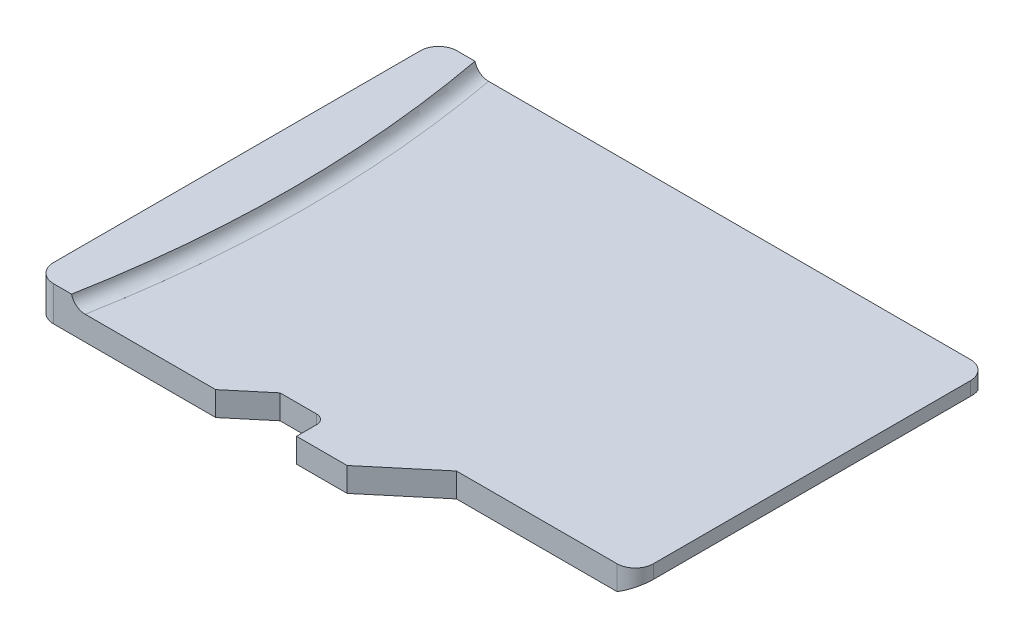
ISO-10303-21;
HEADER;
FILE_DESCRIPTION(('STEP AP214'),'2;1');
FILE_NAME('part.step','',(''),(''),'','','');
FILE_SCHEMA(('AUTOMOTIVE_DESIGN { 1 0 10303 214 1 1 1 1 }'));
ENDSEC;
DATA;
#1=APPLICATION_CONTEXT('core data for automotive mechanical design processes');
#2=APPLICATION_PROTOCOL_DEFINITION('international standard','automotive_design',2000,#1);
#3=PRODUCT_CONTEXT('',#1,'mechanical');
#4=PRODUCT('Part','Part','',(#3));
#5=PRODUCT_RELATED_PRODUCT_CATEGORY('part','',(#4));
#6=PRODUCT_DEFINITION_FORMATION('','',#4);
#7=PRODUCT_DEFINITION_CONTEXT('part definition',#1,'design');
#8=PRODUCT_DEFINITION('design','',#6,#7);
#9=PRODUCT_DEFINITION_SHAPE('','',#8);
#10=(LENGTH_UNIT() NAMED_UNIT(*) SI_UNIT(.MILLI.,.METRE.));
#11=(NAMED_UNIT(*) PLANE_ANGLE_UNIT() SI_UNIT($,.RADIAN.));
#12=(NAMED_UNIT(*) SI_UNIT($,.STERADIAN.) SOLID_ANGLE_UNIT());
#13=UNCERTAINTY_MEASURE_WITH_UNIT(LENGTH_MEASURE(1.E-05),#10,'distance_accuracy_value','');
#14=(GEOMETRIC_REPRESENTATION_CONTEXT(3) GLOBAL_UNCERTAINTY_ASSIGNED_CONTEXT((#13)) GLOBAL_UNIT_ASSIGNED_CONTEXT((#10,
#11,#12)) REPRESENTATION_CONTEXT('',''));
#15=CARTESIAN_POINT('',(0.,0.,0.));
#16=DIRECTION('',(0.,0.,1.));
#17=DIRECTION('',(1.,0.,0.));
#18=AXIS2_PLACEMENT_3D('',#15,#16,#17);
#19=CARTESIAN_POINT('',(-35.9999999999996,1.0349999999999,0.));
#20=DIRECTION('',(0.,1.,0.));
#21=DIRECTION('',(0.,0.,1.));
#22=AXIS2_PLACEMENT_3D('',#19,#20,#21);
#23=TOROIDAL_SURFACE('',#22,30.365239647355,0.375);
#24=CARTESIAN_POINT('',(-35.9999999999996,0.6599999999999,0.));
#25=DIRECTION('',(0.,1.,0.));
#26=DIRECTION('',(0.983459500680866,0.,0.181128160484617));
#27=AXIS2_PLACEMENT_3D('',#24,#25,#26);
#28=CIRCLE('',#27,30.365239647355);
#29=CARTESIAN_POINT('',(-6.13701657835701,0.659999999999921,-5.50000000000005));
#30=VERTEX_POINT('',#29);
#31=CARTESIAN_POINT('',(-6.13701657835701,0.659999999999916,5.49999999999994));
#32=VERTEX_POINT('',#31);
#33=EDGE_CURVE('E102',#30,#32,#28,.F.);
#34=ORIENTED_EDGE('',*,*,#33,.F.);
#35=CARTESIAN_POINT('',(-6.50847579388233,0.949999999999903,-5.50000000000001));
#36=CARTESIAN_POINT('',(-6.50365678408364,0.929561651859177,-5.49999999999993));
#37=CARTESIAN_POINT('',(-6.49706309852533,0.909553416438354,-5.49999999999996));
#38=CARTESIAN_POINT('',(-6.48061867510301,0.870947894944131,-5.50000000000004));
#39=CARTESIAN_POINT('',(-6.47077153495664,0.852349078119381,-5.50000000000007));
#40=CARTESIAN_POINT('',(-6.44809939187905,0.817063812499311,-5.49999999999993));
#41=CARTESIAN_POINT('',(-6.4352740644349,0.800377572400687,-5.49999999999975));
#42=CARTESIAN_POINT('',(-6.40703675834054,0.769368791134943,-5.50000000000025));
#43=CARTESIAN_POINT('',(-6.39162526762855,0.755045805095586,-5.50000000000093));
#44=CARTESIAN_POINT('',(-6.35847645560867,0.728991696924084,-5.50000000000088));
#45=CARTESIAN_POINT('',(-6.34071570183443,0.717290399392818,-5.50000000000013));
#46=CARTESIAN_POINT('',(-6.3034989545367,0.696974508359801,-5.49999999999987));
#47=CARTESIAN_POINT('',(-6.28404211499242,0.688361466383208,-5.50000000000037));
#48=CARTESIAN_POINT('',(-6.24364018092561,0.674332607153745,-5.50000000000056));
#49=CARTESIAN_POINT('',(-6.22267552736294,0.668973134458895,-5.50000000000025));
#50=CARTESIAN_POINT('',(-6.18014701708768,0.661798485204094,-5.49999999999975));
#51=CARTESIAN_POINT('',(-6.15858311235204,0.659983593536863,-5.49999999999958));
#52=CARTESIAN_POINT('',(-6.13701657835932,0.659999999999901,-5.49999999999995));
#53=B_SPLINE_CURVE_WITH_KNOTS('',3,(#35,#36,#37,#38,#39,#40,#41,#42,#43,#44,#45,#46,#47,#48,#49,
#50,#51,#52),.UNSPECIFIED.,.F.,.F.,(4,2,2,2,2,2,2,2,4),(0.,0.0629044013254682,0.125739473567217,
0.188581395737005,0.251411474659881,0.314923622270864,0.378467633526515,0.443082833003335,
0.507703225658798),.UNSPECIFIED.);
#54=CARTESIAN_POINT('',(-6.50847579388233,0.949999999999898,-5.50000000000006));
#55=VERTEX_POINT('',#54);
#56=EDGE_CURVE('E98',#55,#30,#53,.T.);
#57=ORIENTED_EDGE('',*,*,#56,.F.);
#58=CARTESIAN_POINT('',(-35.9999999999996,0.949999999999892,0.));
#59=DIRECTION('',(0.,1.,0.));
#60=DIRECTION('',(0.,0.,1.));
#61=AXIS2_PLACEMENT_3D('',#58,#59,#60);
#62=CIRCLE('',#61,30.);
#63=CARTESIAN_POINT('',(-6.50847579388234,0.949999999999893,5.49999999999995));
#64=VERTEX_POINT('',#63);
#65=EDGE_CURVE('E100',#64,#55,#62,.T.);
#66=ORIENTED_EDGE('',*,*,#65,.F.);
#67=CARTESIAN_POINT('',(-6.13701657835701,0.659999999999899,5.5));
#68=CARTESIAN_POINT('',(-6.15873580518454,0.659983345221313,5.49999999999874));
#69=CARTESIAN_POINT('',(-6.18045166643814,0.661824063070222,5.49999999999926));
#70=CARTESIAN_POINT('',(-6.22327323802776,0.669100141857668,5.50000000000074));
#71=CARTESIAN_POINT('',(-6.2443789444063,0.674535526105842,5.50000000000171));
#72=CARTESIAN_POINT('',(-6.28538790626051,0.688884827550821,5.50000000000095));
#73=CARTESIAN_POINT('',(-6.30529048546467,0.697800680486134,5.49999999999923));
#74=CARTESIAN_POINT('',(-6.34329276541259,0.718867251841736,5.50000000000077));
#75=CARTESIAN_POINT('',(-6.36139328218469,0.731016496845015,5.50000000000404));
#76=CARTESIAN_POINT('',(-6.39513178254897,0.758122729346288,5.50000000000419));
#77=CARTESIAN_POINT('',(-6.41078711201319,0.773058118546989,5.50000000000113));
#78=CARTESIAN_POINT('',(-6.43932177140287,0.805386342610011,5.49999999999887));
#79=CARTESIAN_POINT('',(-6.45220094210723,0.82277931832768,5.49999999999969));
#80=CARTESIAN_POINT('',(-6.47380038096847,0.857945737493751,5.50000000000028));
#81=CARTESIAN_POINT('',(-6.48278238156848,0.875558995131556,5.50000000000014));
#82=CARTESIAN_POINT('',(-6.49785556998301,0.911988044157125,5.49999999999986));
#83=CARTESIAN_POINT('',(-6.5039457336987,0.930804258880781,5.49999999999972));
#84=CARTESIAN_POINT('',(-6.50847579388235,0.949999999999894,5.5));
#85=B_SPLINE_CURVE_WITH_KNOTS('',3,(#67,#68,#69,#70,#71,#72,#73,#74,#75,#76,#77,#78,#79,#80,#81,
#82,#83,#84),.UNSPECIFIED.,.F.,.F.,(4,2,2,2,2,2,2,2,4),(0.,0.0650754392229196,0.130151300432072,
0.195263406684142,0.260345892802461,0.324943377164729,0.389544565402615,0.448612561357574,
0.507701459747772),.UNSPECIFIED.);
#86=EDGE_CURVE('E106',#32,#64,#85,.T.);
#87=ORIENTED_EDGE('',*,*,#86,.F.);
#88=EDGE_LOOP('',(#34,#57,#66,#87));
#89=FACE_BOUND('',#88,.T.);
#90=ADVANCED_FACE('F17',(#89),#23,.F.);
#91=CARTESIAN_POINT('',(-6.99999999999959,0.949999999999891,4.99999999999989));
#92=DIRECTION('',(0.,1.,0.));
#93=DIRECTION('',(0.,0.,1.));
#94=AXIS2_PLACEMENT_3D('',#91,#92,#93);
#95=PLANE('',#94);
#96=DIRECTION('',(0.,0.,-1.));
#97=VECTOR('',#96,1.);
#98=CARTESIAN_POINT('',(-7.5,0.9499999999999,-5.));
#99=LINE('',#98,#97);
#100=CARTESIAN_POINT('',(-7.5,0.9499999999999,-5.));
#101=VERTEX_POINT('',#100);
#102=CARTESIAN_POINT('',(-7.5,0.9499999999999,4.99999999999995));
#103=VERTEX_POINT('',#102);
#104=EDGE_CURVE('E123',#101,#103,#99,.F.);
#105=ORIENTED_EDGE('',*,*,#104,.T.);
#106=CARTESIAN_POINT('',(-7.,0.9499999999999,5.));
#107=DIRECTION('',(0.,-1.,0.));
#108=DIRECTION('',(0.,0.,-1.));
#109=AXIS2_PLACEMENT_3D('',#106,#107,#108);
#110=CIRCLE('',#109,0.5);
#111=CARTESIAN_POINT('',(-7.,0.9499999999999,5.49999999999995));
#112=VERTEX_POINT('',#111);
#113=EDGE_CURVE('E117',#103,#112,#110,.F.);
#114=ORIENTED_EDGE('',*,*,#113,.T.);
#115=DIRECTION('',(1.,0.,0.));
#116=VECTOR('',#115,1.);
#117=CARTESIAN_POINT('',(-6.99999999999959,0.949999999999891,5.4999999999999));
#118=LINE('',#117,#116);
#119=EDGE_CURVE('E91',#112,#64,#118,.T.);
#120=ORIENTED_EDGE('',*,*,#119,.T.);
#121=ORIENTED_EDGE('',*,*,#65,.T.);
#122=DIRECTION('',(1.,0.,0.));
#123=VECTOR('',#122,1.);
#124=CARTESIAN_POINT('',(-6.99999999999959,0.949999999999894,-5.50000000000011));
#125=LINE('',#124,#123);
#126=CARTESIAN_POINT('',(-6.99999999999979,0.9499999999999,-5.50000000000005));
#127=VERTEX_POINT('',#126);
#128=EDGE_CURVE('E110',#55,#127,#125,.F.);
#129=ORIENTED_EDGE('',*,*,#128,.T.);
#130=CARTESIAN_POINT('',(-7.,0.9499999999999,-5.));
#131=DIRECTION('',(0.,-1.,0.));
#132=DIRECTION('',(0.,0.,-1.));
#133=AXIS2_PLACEMENT_3D('',#130,#131,#132);
#134=CIRCLE('',#133,0.5);
#135=EDGE_CURVE('E161',#101,#127,#134,.T.);
#136=ORIENTED_EDGE('',*,*,#135,.F.);
#137=EDGE_LOOP('',(#105,#114,#120,#121,#129,#136));
#138=FACE_BOUND('',#137,.T.);
#139=ADVANCED_FACE('F108',(#138),#95,.T.);
#140=CARTESIAN_POINT('',(7.5,0.95,-5.));
#141=DIRECTION('',(-1.,0.,0.));
#142=DIRECTION('',(0.,0.,1.));
#143=AXIS2_PLACEMENT_3D('',#140,#141,#142);
#144=PLANE('',#143);
#145=DIRECTION('',(0.,0.,1.));
#146=VECTOR('',#145,1.);
#147=CARTESIAN_POINT('',(7.5,0.28867513459481,-5.));
#148=LINE('',#147,#146);
#149=CARTESIAN_POINT('',(7.5,0.288675134594809,3.64));
#150=VERTEX_POINT('',#149);
#151=CARTESIAN_POINT('',(7.5,0.28867513459481,-5.));
#152=VERTEX_POINT('',#151);
#153=EDGE_CURVE('E156',#150,#152,#148,.F.);
#154=ORIENTED_EDGE('',*,*,#153,.T.);
#155=DIRECTION('',(0.,-1.,0.));
#156=VECTOR('',#155,1.);
#157=CARTESIAN_POINT('',(7.5,0.95,-5.));
#158=LINE('',#157,#156);
#159=CARTESIAN_POINT('',(7.5,0.66,-5.));
#160=VERTEX_POINT('',#159);
#161=EDGE_CURVE('E215',#160,#152,#158,.T.);
#162=ORIENTED_EDGE('',*,*,#161,.F.);
#163=DIRECTION('',(0.,0.,1.));
#164=VECTOR('',#163,1.);
#165=CARTESIAN_POINT('',(7.50000000000001,0.66,0.));
#166=LINE('',#165,#164);
#167=CARTESIAN_POINT('',(7.5,0.66,3.64));
#168=VERTEX_POINT('',#167);
#169=EDGE_CURVE('E165',#168,#160,#166,.F.);
#170=ORIENTED_EDGE('',*,*,#169,.F.);
#171=DIRECTION('',(0.,1.,0.));
#172=VECTOR('',#171,1.);
#173=CARTESIAN_POINT('',(7.5,0.,3.64));
#174=LINE('',#173,#172);
#175=EDGE_CURVE('E119',#150,#168,#174,.T.);
#176=ORIENTED_EDGE('',*,*,#175,.F.);
#177=EDGE_LOOP('',(#154,#162,#170,#176));
#178=FACE_BOUND('',#177,.T.);
#179=ADVANCED_FACE('F405',(#178),#144,.F.);
#180=CARTESIAN_POINT('',(7.,0.,3.64));
#181=DIRECTION('',(0.,1.,0.));
#182=DIRECTION('',(0.,0.,1.));
#183=AXIS2_PLACEMENT_3D('',#180,#181,#182);
#184=CYLINDRICAL_SURFACE('',#183,0.5);
#185=ORIENTED_EDGE('',*,*,#175,.T.);
#186=CARTESIAN_POINT('',(7.,0.66,3.64));
#187=DIRECTION('',(0.,1.,0.));
#188=DIRECTION('',(0.,0.,1.));
#189=AXIS2_PLACEMENT_3D('',#186,#187,#188);
#190=CIRCLE('',#189,0.5);
#191=CARTESIAN_POINT('',(7.,0.66,4.14));
#192=VERTEX_POINT('',#191);
#193=EDGE_CURVE('E166',#192,#168,#190,.T.);
#194=ORIENTED_EDGE('',*,*,#193,.F.);
#195=DIRECTION('',(0.,1.,0.));
#196=VECTOR('',#195,1.);
#197=CARTESIAN_POINT('',(7.,0.,4.14));
#198=LINE('',#197,#196);
#199=CARTESIAN_POINT('',(7.,0.,4.14));
#200=VERTEX_POINT('',#199);
#201=EDGE_CURVE('E222',#192,#200,#198,.F.);
#202=ORIENTED_EDGE('',*,*,#201,.T.);
#203=CARTESIAN_POINT('',(7.,0.,3.64));
#204=DIRECTION('',(-0.499999999999996,0.866025403784441,0.));
#205=DIRECTION('',(0.866025403784441,0.499999999999996,0.));
#206=AXIS2_PLACEMENT_3D('',#203,#204,#205);
#207=ELLIPSE('',#206,0.577350269189624,0.5);
#208=EDGE_CURVE('E151',#200,#150,#207,.T.);
#209=ORIENTED_EDGE('',*,*,#208,.T.);
#210=EDGE_LOOP('',(#185,#194,#202,#209));
#211=FACE_BOUND('',#210,.T.);
#212=ADVANCED_FACE('F407',(#211),#184,.T.);
#213=CARTESIAN_POINT('',(7.,0.95,-5.));
#214=DIRECTION('',(0.,-1.,0.));
#215=DIRECTION('',(0.,0.,-1.));
#216=AXIS2_PLACEMENT_3D('',#213,#214,#215);
#217=CYLINDRICAL_SURFACE('',#216,0.5);
#218=DIRECTION('',(0.,1.,0.));
#219=VECTOR('',#218,1.);
#220=CARTESIAN_POINT('',(7.,0.95,-5.5));
#221=LINE('',#220,#219);
#222=CARTESIAN_POINT('',(7.,0.,-5.5));
#223=VERTEX_POINT('',#222);
#224=CARTESIAN_POINT('',(7.,0.66,-5.5));
#225=VERTEX_POINT('',#224);
#226=EDGE_CURVE('E41',#223,#225,#221,.T.);
#227=ORIENTED_EDGE('',*,*,#226,.T.);
#228=CARTESIAN_POINT('',(7.,0.66,-5.));
#229=DIRECTION('',(0.,-1.,0.));
#230=DIRECTION('',(0.,0.,-1.));
#231=AXIS2_PLACEMENT_3D('',#228,#229,#230);
#232=CIRCLE('',#231,0.5);
#233=EDGE_CURVE('E163',#160,#225,#232,.F.);
#234=ORIENTED_EDGE('',*,*,#233,.F.);
#235=ORIENTED_EDGE('',*,*,#161,.T.);
#236=CARTESIAN_POINT('',(7.,0.,-5.));
#237=DIRECTION('',(-0.499999999999996,0.866025403784441,0.));
#238=DIRECTION('',(-0.866025403784441,-0.499999999999996,0.));
#239=AXIS2_PLACEMENT_3D('',#236,#237,#238);
#240=ELLIPSE('',#239,0.577350269189624,0.5);
#241=EDGE_CURVE('E154',#152,#223,#240,.T.);
#242=ORIENTED_EDGE('',*,*,#241,.T.);
#243=EDGE_LOOP('',(#227,#234,#235,#242));
#244=FACE_BOUND('',#243,.T.);
#245=ADVANCED_FACE('F200',(#244),#217,.T.);
#246=CARTESIAN_POINT('',(-102.939905058268,0.66,0.));
#247=DIRECTION('',(0.,1.,0.));
#248=DIRECTION('',(0.,0.,1.));
#249=AXIS2_PLACEMENT_3D('',#246,#247,#248);
#250=PLANE('',#249);
#251=ORIENTED_EDGE('',*,*,#233,.T.);
#252=DIRECTION('',(1.,0.,0.));
#253=VECTOR('',#252,1.);
#254=CARTESIAN_POINT('',(-6.99999999999999,0.66,-5.5));
#255=LINE('',#254,#253);
#256=EDGE_CURVE('E148',#225,#30,#255,.F.);
#257=ORIENTED_EDGE('',*,*,#256,.T.);
#258=ORIENTED_EDGE('',*,*,#33,.T.);
#259=DIRECTION('',(-1.,0.,0.));
#260=VECTOR('',#259,1.);
#261=CARTESIAN_POINT('',(-6.99999999999999,0.659999999999892,5.5));
#262=LINE('',#261,#260);
#263=CARTESIAN_POINT('',(-2.57840287407538,0.659999999999964,5.5));
#264=VERTEX_POINT('',#263);
#265=EDGE_CURVE('E265',#32,#264,#262,.F.);
#266=ORIENTED_EDGE('',*,*,#265,.T.);
#267=DIRECTION('',(-0.766044443118982,0.,0.642787609686535));
#268=VECTOR('',#267,1.);
#269=CARTESIAN_POINT('',(-1.625,0.66,4.7));
#270=LINE('',#269,#268);
#271=CARTESIAN_POINT('',(-1.625,0.66,4.7));
#272=VERTEX_POINT('',#271);
#273=EDGE_CURVE('E248',#264,#272,#270,.F.);
#274=ORIENTED_EDGE('',*,*,#273,.T.);
#275=DIRECTION('',(-1.,0.,0.));
#276=VECTOR('',#275,1.);
#277=CARTESIAN_POINT('',(-0.374999999999999,0.66,4.7));
#278=LINE('',#277,#276);
#279=CARTESIAN_POINT('',(-0.624999999999999,0.66,4.7));
#280=VERTEX_POINT('',#279);
#281=EDGE_CURVE('E243',#272,#280,#278,.F.);
#282=ORIENTED_EDGE('',*,*,#281,.T.);
#283=CARTESIAN_POINT('',(-0.624999999999999,0.66,4.95));
#284=DIRECTION('',(0.,-1.,0.));
#285=DIRECTION('',(0.,0.,-1.));
#286=AXIS2_PLACEMENT_3D('',#283,#284,#285);
#287=CIRCLE('',#286,0.25);
#288=CARTESIAN_POINT('',(-0.374999999999999,0.66,4.95));
#289=VERTEX_POINT('',#288);
#290=EDGE_CURVE('E157',#280,#289,#287,.T.);
#291=ORIENTED_EDGE('',*,*,#290,.T.);
#292=DIRECTION('',(0.,0.,-1.));
#293=VECTOR('',#292,1.);
#294=CARTESIAN_POINT('',(-0.374999999999999,0.66,5.5));
#295=LINE('',#294,#293);
#296=CARTESIAN_POINT('',(-0.374999999999999,0.66,5.5));
#297=VERTEX_POINT('',#296);
#298=EDGE_CURVE('E238',#289,#297,#295,.F.);
#299=ORIENTED_EDGE('',*,*,#298,.T.);
#300=DIRECTION('',(-1.,0.,0.));
#301=VECTOR('',#300,1.);
#302=CARTESIAN_POINT('',(-6.99999999999999,0.66,5.5));
#303=LINE('',#302,#301);
#304=CARTESIAN_POINT('',(1.00421511407186,0.66,5.5));
#305=VERTEX_POINT('',#304);
#306=EDGE_CURVE('E232',#297,#305,#303,.F.);
#307=ORIENTED_EDGE('',*,*,#306,.T.);
#308=DIRECTION('',(-0.766044443118982,0.,0.642787609686535));
#309=VECTOR('',#308,1.);
#310=CARTESIAN_POINT('',(2.625,0.66,4.14));
#311=LINE('',#310,#309);
#312=CARTESIAN_POINT('',(2.625,0.66,4.14));
#313=VERTEX_POINT('',#312);
#314=EDGE_CURVE('E226',#305,#313,#311,.F.);
#315=ORIENTED_EDGE('',*,*,#314,.T.);
#316=DIRECTION('',(-1.,0.,0.));
#317=VECTOR('',#316,1.);
#318=CARTESIAN_POINT('',(7.5,0.66,4.14));
#319=LINE('',#318,#317);
#320=EDGE_CURVE('E219',#313,#192,#319,.F.);
#321=ORIENTED_EDGE('',*,*,#320,.T.);
#322=ORIENTED_EDGE('',*,*,#193,.T.);
#323=ORIENTED_EDGE('',*,*,#169,.T.);
#324=EDGE_LOOP('',(#251,#257,#258,#266,#274,#282,#291,#299,#307,#315,#321,#322,#323));
#325=FACE_BOUND('',#324,.T.);
#326=ADVANCED_FACE('F195',(#325),#250,.T.);
#327=CARTESIAN_POINT('',(-7.,0.95,-5.));
#328=DIRECTION('',(0.,-1.,0.));
#329=DIRECTION('',(0.,0.,-1.));
#330=AXIS2_PLACEMENT_3D('',#327,#328,#329);
#331=CYLINDRICAL_SURFACE('',#330,0.5);
#332=DIRECTION('',(0.,1.,0.));
#333=VECTOR('',#332,1.);
#334=CARTESIAN_POINT('',(-7.5,0.95,-5.));
#335=LINE('',#334,#333);
#336=CARTESIAN_POINT('',(-7.5,0.,-5.));
#337=VERTEX_POINT('',#336);
#338=EDGE_CURVE('E278',#337,#101,#335,.T.);
#339=ORIENTED_EDGE('',*,*,#338,.T.);
#340=ORIENTED_EDGE('',*,*,#135,.T.);
#341=DIRECTION('',(0.,1.,0.));
#342=VECTOR('',#341,1.);
#343=CARTESIAN_POINT('',(-6.99999999999959,0.95,-5.5));
#344=LINE('',#343,#342);
#345=CARTESIAN_POINT('',(-6.99999999999979,0.,-5.5));
#346=VERTEX_POINT('',#345);
#347=EDGE_CURVE('E116',#127,#346,#344,.F.);
#348=ORIENTED_EDGE('',*,*,#347,.T.);
#349=CARTESIAN_POINT('',(-7.,0.,-5.));
#350=DIRECTION('',(0.,-1.,0.));
#351=DIRECTION('',(0.,0.,-1.));
#352=AXIS2_PLACEMENT_3D('',#349,#350,#351);
#353=CIRCLE('',#352,0.5);
#354=EDGE_CURVE('E145',#346,#337,#353,.F.);
#355=ORIENTED_EDGE('',*,*,#354,.T.);
#356=EDGE_LOOP('',(#339,#340,#348,#355));
#357=FACE_BOUND('',#356,.T.);
#358=ADVANCED_FACE('F191',(#357),#331,.T.);
#359=CARTESIAN_POINT('',(-7.5,0.95,-5.));
#360=DIRECTION('',(1.,0.,0.));
#361=DIRECTION('',(0.,0.,-1.));
#362=AXIS2_PLACEMENT_3D('',#359,#360,#361);
#363=PLANE('',#362);
#364=DIRECTION('',(0.,0.,1.));
#365=VECTOR('',#364,1.);
#366=CARTESIAN_POINT('',(-7.5,0.,5.));
#367=LINE('',#366,#365);
#368=CARTESIAN_POINT('',(-7.5,0.,4.99999999999995));
#369=VERTEX_POINT('',#368);
#370=EDGE_CURVE('E144',#337,#369,#367,.T.);
#371=ORIENTED_EDGE('',*,*,#370,.T.);
#372=DIRECTION('',(0.,-1.,0.));
#373=VECTOR('',#372,1.);
#374=CARTESIAN_POINT('',(-7.5,0.95,4.99999999999989));
#375=LINE('',#374,#373);
#376=EDGE_CURVE('E274',#103,#369,#375,.T.);
#377=ORIENTED_EDGE('',*,*,#376,.F.);
#378=ORIENTED_EDGE('',*,*,#104,.F.);
#379=ORIENTED_EDGE('',*,*,#338,.F.);
#380=EDGE_LOOP('',(#371,#377,#378,#379));
#381=FACE_BOUND('',#380,.T.);
#382=ADVANCED_FACE('F187',(#381),#363,.F.);
#383=CARTESIAN_POINT('',(-7.,0.95,5.));
#384=DIRECTION('',(0.,-1.,0.));
#385=DIRECTION('',(0.,0.,-1.));
#386=AXIS2_PLACEMENT_3D('',#383,#384,#385);
#387=CYLINDRICAL_SURFACE('',#386,0.5);
#388=DIRECTION('',(0.,1.,0.));
#389=VECTOR('',#388,1.);
#390=CARTESIAN_POINT('',(-6.99999999999999,0.95,5.5));
#391=LINE('',#390,#389);
#392=CARTESIAN_POINT('',(-7.,0.,5.5));
#393=VERTEX_POINT('',#392);
#394=EDGE_CURVE('E258',#393,#112,#391,.T.);
#395=ORIENTED_EDGE('',*,*,#394,.T.);
#396=ORIENTED_EDGE('',*,*,#113,.F.);
#397=ORIENTED_EDGE('',*,*,#376,.T.);
#398=CARTESIAN_POINT('',(-7.,0.,5.));
#399=DIRECTION('',(0.,-1.,0.));
#400=DIRECTION('',(0.,0.,-1.));
#401=AXIS2_PLACEMENT_3D('',#398,#399,#400);
#402=CIRCLE('',#401,0.5);
#403=EDGE_CURVE('E140',#369,#393,#402,.F.);
#404=ORIENTED_EDGE('',*,*,#403,.T.);
#405=EDGE_LOOP('',(#395,#396,#397,#404));
#406=FACE_BOUND('',#405,.T.);
#407=ADVANCED_FACE('F182',(#406),#387,.T.);
#408=CARTESIAN_POINT('',(-6.99999999999999,0.95,5.5));
#409=DIRECTION('',(0.,0.,-1.));
#410=DIRECTION('',(-1.,0.,0.));
#411=AXIS2_PLACEMENT_3D('',#408,#409,#410);
#412=PLANE('',#411);
#413=DIRECTION('',(1.,0.,0.));
#414=VECTOR('',#413,1.);
#415=CARTESIAN_POINT('',(-7.,0.,5.5));
#416=LINE('',#415,#414);
#417=CARTESIAN_POINT('',(-2.57840287407538,0.,5.5));
#418=VERTEX_POINT('',#417);
#419=EDGE_CURVE('E143',#393,#418,#416,.T.);
#420=ORIENTED_EDGE('',*,*,#419,.T.);
#421=DIRECTION('',(0.,1.,0.));
#422=VECTOR('',#421,1.);
#423=CARTESIAN_POINT('',(-2.57840287407538,0.,5.5));
#424=LINE('',#423,#422);
#425=EDGE_CURVE('E250',#418,#264,#424,.T.);
#426=ORIENTED_EDGE('',*,*,#425,.T.);
#427=ORIENTED_EDGE('',*,*,#265,.F.);
#428=ORIENTED_EDGE('',*,*,#86,.T.);
#429=ORIENTED_EDGE('',*,*,#119,.F.);
#430=ORIENTED_EDGE('',*,*,#394,.F.);
#431=EDGE_LOOP('',(#420,#426,#427,#428,#429,#430));
#432=FACE_BOUND('',#431,.T.);
#433=ADVANCED_FACE('F176',(#432),#412,.F.);
#434=CARTESIAN_POINT('',(-1.625,0.,4.7));
#435=DIRECTION('',(-0.642787609686535,0.,-0.766044443118982));
#436=DIRECTION('',(-0.766044443118982,0.,0.642787609686535));
#437=AXIS2_PLACEMENT_3D('',#434,#435,#436);
#438=PLANE('',#437);
#439=ORIENTED_EDGE('',*,*,#425,.F.);
#440=DIRECTION('',(0.766044443118982,0.,-0.642787609686534));
#441=VECTOR('',#440,1.);
#442=CARTESIAN_POINT('',(-2.57840287407538,0.,5.5));
#443=LINE('',#442,#441);
#444=CARTESIAN_POINT('',(-1.625,0.,4.7));
#445=VERTEX_POINT('',#444);
#446=EDGE_CURVE('E298',#418,#445,#443,.T.);
#447=ORIENTED_EDGE('',*,*,#446,.T.);
#448=DIRECTION('',(0.,1.,0.));
#449=VECTOR('',#448,1.);
#450=CARTESIAN_POINT('',(-1.625,0.,4.7));
#451=LINE('',#450,#449);
#452=EDGE_CURVE('E245',#445,#272,#451,.T.);
#453=ORIENTED_EDGE('',*,*,#452,.T.);
#454=ORIENTED_EDGE('',*,*,#273,.F.);
#455=EDGE_LOOP('',(#439,#447,#453,#454));
#456=FACE_BOUND('',#455,.T.);
#457=ADVANCED_FACE('F181',(#456),#438,.F.);
#458=CARTESIAN_POINT('',(-0.374999999999999,0.,4.7));
#459=DIRECTION('',(0.,0.,-1.));
#460=DIRECTION('',(-1.,0.,0.));
#461=AXIS2_PLACEMENT_3D('',#458,#459,#460);
#462=PLANE('',#461);
#463=DIRECTION('',(0.,-1.,0.));
#464=VECTOR('',#463,1.);
#465=CARTESIAN_POINT('',(-0.624999999999999,0.,4.7));
#466=LINE('',#465,#464);
#467=CARTESIAN_POINT('',(-0.624999999999999,0.,4.7));
#468=VERTEX_POINT('',#467);
#469=EDGE_CURVE('E160',#468,#280,#466,.F.);
#470=ORIENTED_EDGE('',*,*,#469,.T.);
#471=ORIENTED_EDGE('',*,*,#281,.F.);
#472=ORIENTED_EDGE('',*,*,#452,.F.);
#473=DIRECTION('',(1.,0.,0.));
#474=VECTOR('',#473,1.);
#475=CARTESIAN_POINT('',(-7.,0.,4.7));
#476=LINE('',#475,#474);
#477=EDGE_CURVE('E139',#445,#468,#476,.T.);
#478=ORIENTED_EDGE('',*,*,#477,.T.);
#479=EDGE_LOOP('',(#470,#471,#472,#478));
#480=FACE_BOUND('',#479,.T.);
#481=ADVANCED_FACE('F353',(#480),#462,.F.);
#482=CARTESIAN_POINT('',(-0.624999999999999,0.,4.95));
#483=DIRECTION('',(0.,-1.,0.));
#484=DIRECTION('',(0.,0.,-1.));
#485=AXIS2_PLACEMENT_3D('',#482,#483,#484);
#486=CYLINDRICAL_SURFACE('',#485,0.25);
#487=DIRECTION('',(0.,1.,0.));
#488=VECTOR('',#487,1.);
#489=CARTESIAN_POINT('',(-0.374999999999999,0.,4.95));
#490=LINE('',#489,#488);
#491=CARTESIAN_POINT('',(-0.374999999999999,0.,4.95));
#492=VERTEX_POINT('',#491);
#493=EDGE_CURVE('E159',#492,#289,#490,.T.);
#494=ORIENTED_EDGE('',*,*,#493,.T.);
#495=ORIENTED_EDGE('',*,*,#290,.F.);
#496=ORIENTED_EDGE('',*,*,#469,.F.);
#497=CARTESIAN_POINT('',(-0.624999999999999,0.,4.95));
#498=DIRECTION('',(0.,-1.,0.));
#499=DIRECTION('',(0.,0.,-1.));
#500=AXIS2_PLACEMENT_3D('',#497,#498,#499);
#501=CIRCLE('',#500,0.25);
#502=EDGE_CURVE('E130',#468,#492,#501,.T.);
#503=ORIENTED_EDGE('',*,*,#502,.T.);
#504=EDGE_LOOP('',(#494,#495,#496,#503));
#505=FACE_BOUND('',#504,.T.);
#506=ADVANCED_FACE('F359',(#505),#486,.F.);
#507=CARTESIAN_POINT('',(-0.374999999999999,0.,5.5));
#508=DIRECTION('',(1.,0.,0.));
#509=DIRECTION('',(0.,0.,-1.));
#510=AXIS2_PLACEMENT_3D('',#507,#508,#509);
#511=PLANE('',#510);
#512=ORIENTED_EDGE('',*,*,#493,.F.);
#513=DIRECTION('',(0.,0.,1.));
#514=VECTOR('',#513,1.);
#515=CARTESIAN_POINT('',(-0.374999999999999,0.,5.));
#516=LINE('',#515,#514);
#517=CARTESIAN_POINT('',(-0.374999999999999,0.,5.5));
#518=VERTEX_POINT('',#517);
#519=EDGE_CURVE('E138',#492,#518,#516,.T.);
#520=ORIENTED_EDGE('',*,*,#519,.T.);
#521=DIRECTION('',(0.,1.,0.));
#522=VECTOR('',#521,1.);
#523=CARTESIAN_POINT('',(-0.374999999999999,0.95,5.5));
#524=LINE('',#523,#522);
#525=EDGE_CURVE('E235',#518,#297,#524,.T.);
#526=ORIENTED_EDGE('',*,*,#525,.T.);
#527=ORIENTED_EDGE('',*,*,#298,.F.);
#528=EDGE_LOOP('',(#512,#520,#526,#527));
#529=FACE_BOUND('',#528,.T.);
#530=ADVANCED_FACE('F374',(#529),#511,.F.);
#531=CARTESIAN_POINT('',(-6.99999999999999,0.95,5.5));
#532=DIRECTION('',(0.,0.,-1.));
#533=DIRECTION('',(-1.,0.,0.));
#534=AXIS2_PLACEMENT_3D('',#531,#532,#533);
#535=PLANE('',#534);
#536=DIRECTION('',(0.,1.,0.));
#537=VECTOR('',#536,1.);
#538=CARTESIAN_POINT('',(1.00421511407186,0.,5.5));
#539=LINE('',#538,#537);
#540=CARTESIAN_POINT('',(1.00421511407186,0.,5.5));
#541=VERTEX_POINT('',#540);
#542=EDGE_CURVE('E229',#541,#305,#539,.T.);
#543=ORIENTED_EDGE('',*,*,#542,.T.);
#544=ORIENTED_EDGE('',*,*,#306,.F.);
#545=ORIENTED_EDGE('',*,*,#525,.F.);
#546=DIRECTION('',(1.,0.,0.));
#547=VECTOR('',#546,1.);
#548=CARTESIAN_POINT('',(-7.,0.,5.5));
#549=LINE('',#548,#547);
#550=EDGE_CURVE('E330',#518,#541,#549,.T.);
#551=ORIENTED_EDGE('',*,*,#550,.T.);
#552=EDGE_LOOP('',(#543,#544,#545,#551));
#553=FACE_BOUND('',#552,.T.);
#554=ADVANCED_FACE('F419',(#553),#535,.F.);
#555=CARTESIAN_POINT('',(2.625,0.,4.14));
#556=DIRECTION('',(-0.642787609686535,0.,-0.766044443118982));
#557=DIRECTION('',(-0.766044443118982,0.,0.642787609686535));
#558=AXIS2_PLACEMENT_3D('',#555,#556,#557);
#559=PLANE('',#558);
#560=ORIENTED_EDGE('',*,*,#542,.F.);
#561=DIRECTION('',(0.766044443118981,0.,-0.642787609686536));
#562=VECTOR('',#561,1.);
#563=CARTESIAN_POINT('',(1.00421511407186,0.,5.5));
#564=LINE('',#563,#562);
#565=CARTESIAN_POINT('',(2.625,0.,4.14));
#566=VERTEX_POINT('',#565);
#567=EDGE_CURVE('E319',#541,#566,#564,.T.);
#568=ORIENTED_EDGE('',*,*,#567,.T.);
#569=DIRECTION('',(0.,1.,0.));
#570=VECTOR('',#569,1.);
#571=CARTESIAN_POINT('',(2.625,0.,4.14));
#572=LINE('',#571,#570);
#573=EDGE_CURVE('E223',#566,#313,#572,.T.);
#574=ORIENTED_EDGE('',*,*,#573,.T.);
#575=ORIENTED_EDGE('',*,*,#314,.F.);
#576=EDGE_LOOP('',(#560,#568,#574,#575));
#577=FACE_BOUND('',#576,.T.);
#578=ADVANCED_FACE('F417',(#577),#559,.F.);
#579=CARTESIAN_POINT('',(7.5,0.,4.14));
#580=DIRECTION('',(0.,0.,-1.));
#581=DIRECTION('',(-1.,0.,0.));
#582=AXIS2_PLACEMENT_3D('',#579,#580,#581);
#583=PLANE('',#582);
#584=ORIENTED_EDGE('',*,*,#201,.F.);
#585=ORIENTED_EDGE('',*,*,#320,.F.);
#586=ORIENTED_EDGE('',*,*,#573,.F.);
#587=DIRECTION('',(1.,0.,0.));
#588=VECTOR('',#587,1.);
#589=CARTESIAN_POINT('',(-7.,0.,4.14));
#590=LINE('',#589,#588);
#591=EDGE_CURVE('E314',#566,#200,#590,.T.);
#592=ORIENTED_EDGE('',*,*,#591,.T.);
#593=EDGE_LOOP('',(#584,#585,#586,#592));
#594=FACE_BOUND('',#593,.T.);
#595=ADVANCED_FACE('F413',(#594),#583,.F.);
#596=CARTESIAN_POINT('',(7.5,0.28867513459481,-5.));
#597=DIRECTION('',(-0.499999999999996,0.866025403784441,0.));
#598=DIRECTION('',(-0.866025403784441,-0.499999999999996,0.));
#599=AXIS2_PLACEMENT_3D('',#596,#597,#598);
#600=PLANE('',#599);
#601=DIRECTION('',(0.,0.,1.));
#602=VECTOR('',#601,1.);
#603=CARTESIAN_POINT('',(7.,0.,5.));
#604=LINE('',#603,#602);
#605=EDGE_CURVE('E33',#200,#223,#604,.F.);
#606=ORIENTED_EDGE('',*,*,#605,.T.);
#607=ORIENTED_EDGE('',*,*,#241,.F.);
#608=ORIENTED_EDGE('',*,*,#153,.F.);
#609=ORIENTED_EDGE('',*,*,#208,.F.);
#610=EDGE_LOOP('',(#606,#607,#608,#609));
#611=FACE_BOUND('',#610,.T.);
#612=ADVANCED_FACE('F404',(#611),#600,.F.);
#613=CARTESIAN_POINT('',(-6.99999999999999,0.95,-5.5));
#614=DIRECTION('',(0.,0.,1.));
#615=DIRECTION('',(1.,0.,0.));
#616=AXIS2_PLACEMENT_3D('',#613,#614,#615);
#617=PLANE('',#616);
#618=ORIENTED_EDGE('',*,*,#226,.F.);
#619=DIRECTION('',(1.,0.,0.));
#620=VECTOR('',#619,1.);
#621=CARTESIAN_POINT('',(-7.,0.,-5.5));
#622=LINE('',#621,#620);
#623=EDGE_CURVE('E11',#223,#346,#622,.F.);
#624=ORIENTED_EDGE('',*,*,#623,.T.);
#625=ORIENTED_EDGE('',*,*,#347,.F.);
#626=ORIENTED_EDGE('',*,*,#128,.F.);
#627=ORIENTED_EDGE('',*,*,#56,.T.);
#628=ORIENTED_EDGE('',*,*,#256,.F.);
#629=EDGE_LOOP('',(#618,#624,#625,#626,#627,#628));
#630=FACE_BOUND('',#629,.T.);
#631=ADVANCED_FACE('F114',(#630),#617,.F.);
#632=CARTESIAN_POINT('',(-7.,0.,5.));
#633=DIRECTION('',(0.,1.,0.));
#634=DIRECTION('',(0.,0.,1.));
#635=AXIS2_PLACEMENT_3D('',#632,#633,#634);
#636=PLANE('',#635);
#637=ORIENTED_EDGE('',*,*,#605,.F.);
#638=ORIENTED_EDGE('',*,*,#591,.F.);
#639=ORIENTED_EDGE('',*,*,#567,.F.);
#640=ORIENTED_EDGE('',*,*,#550,.F.);
#641=ORIENTED_EDGE('',*,*,#519,.F.);
#642=ORIENTED_EDGE('',*,*,#502,.F.);
#643=ORIENTED_EDGE('',*,*,#477,.F.);
#644=ORIENTED_EDGE('',*,*,#446,.F.);
#645=ORIENTED_EDGE('',*,*,#419,.F.);
#646=ORIENTED_EDGE('',*,*,#403,.F.);
#647=ORIENTED_EDGE('',*,*,#370,.F.);
#648=ORIENTED_EDGE('',*,*,#354,.F.);
#649=ORIENTED_EDGE('',*,*,#623,.F.);
#650=EDGE_LOOP('',(#637,#638,#639,#640,#641,#642,#643,#644,#645,#646,#647,#648,#649));
#651=FACE_BOUND('',#650,.T.);
#652=ADVANCED_FACE('F292',(#651),#636,.F.);
#653=CLOSED_SHELL('',(#90,#139,#179,#212,#245,#326,#358,#382,#407,#433,#457,#481,#506,#530,#554,
#578,#595,#612,#631,#652));
#654=MANIFOLD_SOLID_BREP('B1',#653);
#655=ADVANCED_BREP_SHAPE_REPRESENTATION('',(#18,#654),#14);
#656=SHAPE_DEFINITION_REPRESENTATION(#9,#655);
ENDSEC;
END-ISO-10303-21;
